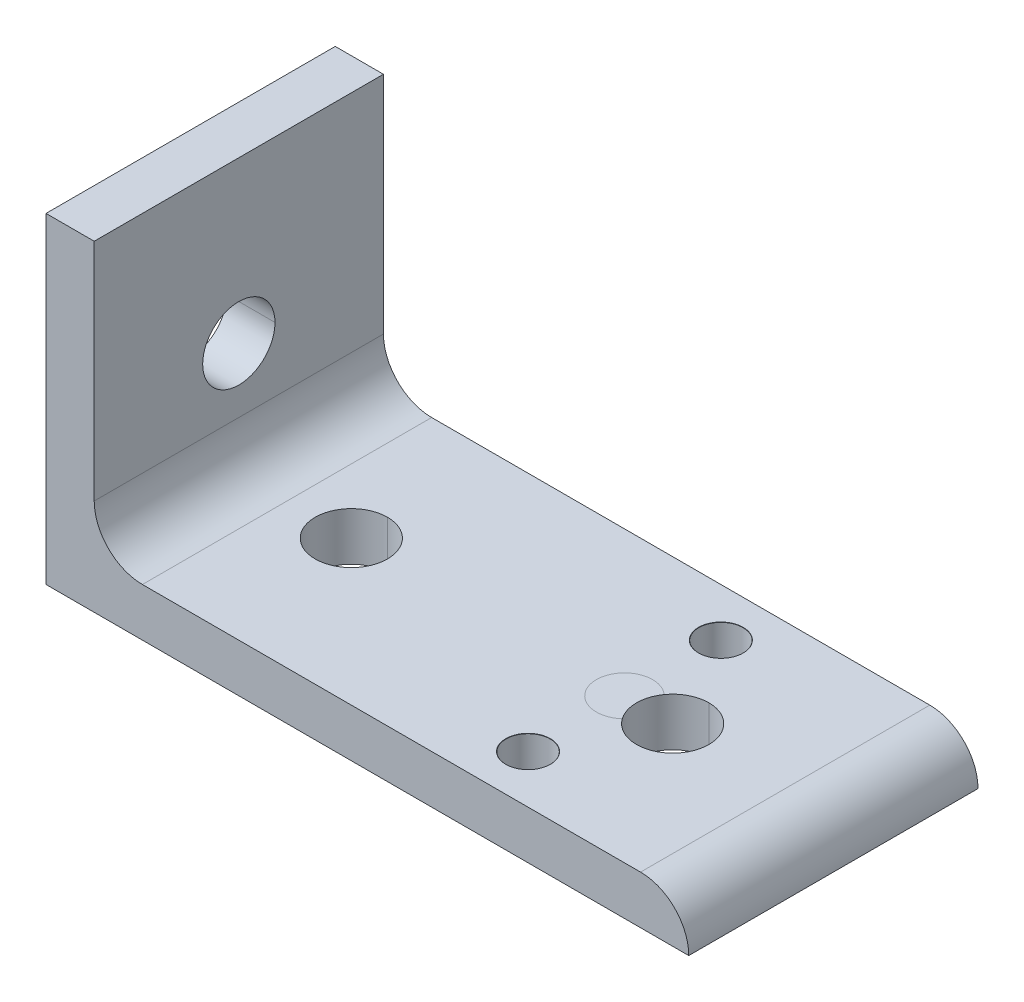
ISO-10303-21;
HEADER;
FILE_DESCRIPTION(('STEP AP214'),'2;1');
FILE_NAME('part.step','',(''),(''),'','','');
FILE_SCHEMA(('AUTOMOTIVE_DESIGN { 1 0 10303 214 1 1 1 1 }'));
ENDSEC;
DATA;
#1=APPLICATION_CONTEXT('core data for automotive mechanical design processes');
#2=APPLICATION_PROTOCOL_DEFINITION('international standard','automotive_design',2000,#1);
#3=PRODUCT_CONTEXT('',#1,'mechanical');
#4=PRODUCT('Part','Part','',(#3));
#5=PRODUCT_RELATED_PRODUCT_CATEGORY('part','',(#4));
#6=PRODUCT_DEFINITION_FORMATION('','',#4);
#7=PRODUCT_DEFINITION_CONTEXT('part definition',#1,'design');
#8=PRODUCT_DEFINITION('design','',#6,#7);
#9=PRODUCT_DEFINITION_SHAPE('','',#8);
#10=(LENGTH_UNIT() NAMED_UNIT(*) SI_UNIT(.MILLI.,.METRE.));
#11=(NAMED_UNIT(*) PLANE_ANGLE_UNIT() SI_UNIT($,.RADIAN.));
#12=(NAMED_UNIT(*) SI_UNIT($,.STERADIAN.) SOLID_ANGLE_UNIT());
#13=UNCERTAINTY_MEASURE_WITH_UNIT(LENGTH_MEASURE(1.E-05),#10,'distance_accuracy_value','');
#14=(GEOMETRIC_REPRESENTATION_CONTEXT(3) GLOBAL_UNCERTAINTY_ASSIGNED_CONTEXT((#13)) GLOBAL_UNIT_ASSIGNED_CONTEXT((#10,
#11,#12)) REPRESENTATION_CONTEXT('',''));
#15=CARTESIAN_POINT('',(0.,0.,0.));
#16=DIRECTION('',(0.,0.,1.));
#17=DIRECTION('',(1.,0.,0.));
#18=AXIS2_PLACEMENT_3D('',#15,#16,#17);
#19=CARTESIAN_POINT('',(12.,6.,18.));
#20=DIRECTION('',(0.,-1.,0.));
#21=DIRECTION('',(-1.,0.,0.));
#22=AXIS2_PLACEMENT_3D('',#19,#20,#21);
#23=PLANE('',#22);
#24=DIRECTION('',(-1.,0.,0.));
#25=VECTOR('',#24,1.);
#26=CARTESIAN_POINT('',(12.,6.,-18.));
#27=LINE('',#26,#25);
#28=CARTESIAN_POINT('',(74.,6.,-18.));
#29=VERTEX_POINT('',#28);
#30=CARTESIAN_POINT('',(12.,6.,-18.));
#31=VERTEX_POINT('',#30);
#32=EDGE_CURVE('E247',#29,#31,#27,.T.);
#33=ORIENTED_EDGE('',*,*,#32,.T.);
#34=DIRECTION('',(0.,0.,-1.));
#35=VECTOR('',#34,1.);
#36=CARTESIAN_POINT('',(12.,6.,18.));
#37=LINE('',#36,#35);
#38=CARTESIAN_POINT('',(12.,6.,18.));
#39=VERTEX_POINT('',#38);
#40=EDGE_CURVE('E253',#39,#31,#37,.T.);
#41=ORIENTED_EDGE('',*,*,#40,.F.);
#42=DIRECTION('',(-1.,0.,0.));
#43=VECTOR('',#42,1.);
#44=CARTESIAN_POINT('',(12.,6.,18.));
#45=LINE('',#44,#43);
#46=CARTESIAN_POINT('',(74.,6.,18.));
#47=VERTEX_POINT('',#46);
#48=EDGE_CURVE('E256',#47,#39,#45,.T.);
#49=ORIENTED_EDGE('',*,*,#48,.F.);
#50=DIRECTION('',(0.,0.,-1.));
#51=VECTOR('',#50,1.);
#52=CARTESIAN_POINT('',(74.,6.,18.));
#53=LINE('',#52,#51);
#54=EDGE_CURVE('E261',#47,#29,#53,.T.);
#55=ORIENTED_EDGE('',*,*,#54,.T.);
#56=EDGE_LOOP('',(#33,#41,#49,#55));
#57=FACE_BOUND('',#56,.T.);
#58=CARTESIAN_POINT('',(20.,6.,0.));
#59=DIRECTION('',(0.,1.,0.));
#60=DIRECTION('',(1.,0.,0.));
#61=AXIS2_PLACEMENT_3D('',#58,#59,#60);
#62=CIRCLE('',#61,4.5);
#63=CARTESIAN_POINT('',(20.,6.,-4.5));
#64=VERTEX_POINT('',#63);
#65=CARTESIAN_POINT('',(20.,6.,4.5));
#66=VERTEX_POINT('',#65);
#67=EDGE_CURVE('E350',#64,#66,#62,.T.);
#68=ORIENTED_EDGE('',*,*,#67,.F.);
#69=CARTESIAN_POINT('',(20.,6.,0.));
#70=DIRECTION('',(0.,1.,0.));
#71=DIRECTION('',(1.,0.,0.));
#72=AXIS2_PLACEMENT_3D('',#69,#70,#71);
#73=CIRCLE('',#72,4.5);
#74=EDGE_CURVE('E265',#66,#64,#73,.T.);
#75=ORIENTED_EDGE('',*,*,#74,.F.);
#76=EDGE_LOOP('',(#68,#75));
#77=FACE_BOUND('',#76,.T.);
#78=CARTESIAN_POINT('',(54.,6.,-12.));
#79=DIRECTION('',(0.,1.,0.));
#80=DIRECTION('',(0.,0.,1.));
#81=AXIS2_PLACEMENT_3D('',#78,#79,#80);
#82=CIRCLE('',#81,2.775);
#83=CARTESIAN_POINT('',(54.,6.,-9.225));
#84=VERTEX_POINT('',#83);
#85=EDGE_CURVE('E284',#84,#84,#82,.T.);
#86=ORIENTED_EDGE('',*,*,#85,.F.);
#87=EDGE_LOOP('',(#86));
#88=FACE_BOUND('',#87,.T.);
#89=CARTESIAN_POINT('',(54.,6.,12.));
#90=DIRECTION('',(0.,1.,0.));
#91=DIRECTION('',(0.,0.,1.));
#92=AXIS2_PLACEMENT_3D('',#89,#90,#91);
#93=CIRCLE('',#92,2.775);
#94=CARTESIAN_POINT('',(54.,6.,14.775));
#95=VERTEX_POINT('',#94);
#96=EDGE_CURVE('E293',#95,#95,#93,.T.);
#97=ORIENTED_EDGE('',*,*,#96,.F.);
#98=EDGE_LOOP('',(#97));
#99=FACE_BOUND('',#98,.T.);
#100=CARTESIAN_POINT('',(54.,6.,0.));
#101=DIRECTION('',(0.,-1.,0.));
#102=DIRECTION('',(1.,0.,0.));
#103=AXIS2_PLACEMENT_3D('',#100,#101,#102);
#104=CIRCLE('',#103,3.5);
#105=CARTESIAN_POINT('',(56.3333333333333,6.,-2.60874597374976));
#106=VERTEX_POINT('',#105);
#107=CARTESIAN_POINT('',(56.3333333333333,6.,2.60874597374976));
#108=VERTEX_POINT('',#107);
#109=EDGE_CURVE('E12',#106,#108,#104,.F.);
#110=ORIENTED_EDGE('',*,*,#109,.F.);
#111=CARTESIAN_POINT('',(60.,6.,0.));
#112=DIRECTION('',(0.,1.,0.));
#113=DIRECTION('',(1.,0.,0.));
#114=AXIS2_PLACEMENT_3D('',#111,#112,#113);
#115=CIRCLE('',#114,4.5);
#116=CARTESIAN_POINT('',(60.,6.,-4.5));
#117=VERTEX_POINT('',#116);
#118=EDGE_CURVE('E328',#117,#106,#115,.T.);
#119=ORIENTED_EDGE('',*,*,#118,.F.);
#120=CARTESIAN_POINT('',(60.,6.,0.));
#121=DIRECTION('',(0.,1.,0.));
#122=DIRECTION('',(1.,0.,0.));
#123=AXIS2_PLACEMENT_3D('',#120,#121,#122);
#124=CIRCLE('',#123,4.5);
#125=CARTESIAN_POINT('',(60.,6.,4.5));
#126=VERTEX_POINT('',#125);
#127=EDGE_CURVE('E266',#126,#117,#124,.T.);
#128=ORIENTED_EDGE('',*,*,#127,.F.);
#129=EDGE_CURVE('E338',#108,#126,#115,.T.);
#130=ORIENTED_EDGE('',*,*,#129,.F.);
#131=EDGE_LOOP('',(#110,#119,#128,#130));
#132=FACE_BOUND('',#131,.T.);
#133=ADVANCED_FACE('F63',(#57,#77,#88,#99,#132),#23,.F.);
#134=CARTESIAN_POINT('',(80.,20.,0.));
#135=DIRECTION('',(-1.,0.,0.));
#136=DIRECTION('',(0.,0.,1.));
#137=AXIS2_PLACEMENT_3D('',#134,#135,#136);
#138=CYLINDRICAL_SURFACE('',#137,4.5);
#139=DIRECTION('',(-1.,0.,0.));
#140=VECTOR('',#139,1.);
#141=CARTESIAN_POINT('',(80.,20.,-4.5));
#142=LINE('',#141,#140);
#143=CARTESIAN_POINT('',(6.,20.,-4.5));
#144=VERTEX_POINT('',#143);
#145=CARTESIAN_POINT('',(0.,20.,-4.5));
#146=VERTEX_POINT('',#145);
#147=EDGE_CURVE('E318',#144,#146,#142,.T.);
#148=ORIENTED_EDGE('',*,*,#147,.F.);
#149=CARTESIAN_POINT('',(6.,20.,0.));
#150=DIRECTION('',(1.,0.,0.));
#151=DIRECTION('',(0.,-1.,0.));
#152=AXIS2_PLACEMENT_3D('',#149,#150,#151);
#153=CIRCLE('',#152,4.5);
#154=CARTESIAN_POINT('',(6.,20.,4.5));
#155=VERTEX_POINT('',#154);
#156=EDGE_CURVE('E223',#144,#155,#153,.T.);
#157=ORIENTED_EDGE('',*,*,#156,.T.);
#158=DIRECTION('',(-1.,0.,0.));
#159=VECTOR('',#158,1.);
#160=CARTESIAN_POINT('',(80.,20.,4.5));
#161=LINE('',#160,#159);
#162=CARTESIAN_POINT('',(0.,20.,4.5));
#163=VERTEX_POINT('',#162);
#164=EDGE_CURVE('E332',#155,#163,#161,.T.);
#165=ORIENTED_EDGE('',*,*,#164,.T.);
#166=CARTESIAN_POINT('',(0.,20.,0.));
#167=DIRECTION('',(1.,0.,0.));
#168=DIRECTION('',(0.,0.,-1.));
#169=AXIS2_PLACEMENT_3D('',#166,#167,#168);
#170=CIRCLE('',#169,4.5);
#171=EDGE_CURVE('E229',#146,#163,#170,.T.);
#172=ORIENTED_EDGE('',*,*,#171,.F.);
#173=EDGE_LOOP('',(#148,#157,#165,#172));
#174=FACE_BOUND('',#173,.T.);
#175=ADVANCED_FACE('F379',(#174),#138,.F.);
#176=CARTESIAN_POINT('',(60.,80.,0.));
#177=DIRECTION('',(0.,-1.,0.));
#178=DIRECTION('',(0.,0.,-1.));
#179=AXIS2_PLACEMENT_3D('',#176,#177,#178);
#180=CYLINDRICAL_SURFACE('',#179,4.5);
#181=DIRECTION('',(0.,-1.,0.));
#182=VECTOR('',#181,1.);
#183=CARTESIAN_POINT('',(60.,80.,4.5));
#184=LINE('',#183,#182);
#185=CARTESIAN_POINT('',(60.,0.,4.5));
#186=VERTEX_POINT('',#185);
#187=EDGE_CURVE('E323',#126,#186,#184,.T.);
#188=ORIENTED_EDGE('',*,*,#187,.F.);
#189=ORIENTED_EDGE('',*,*,#127,.T.);
#190=DIRECTION('',(0.,-1.,0.));
#191=VECTOR('',#190,1.);
#192=CARTESIAN_POINT('',(60.,80.,-4.5));
#193=LINE('',#192,#191);
#194=CARTESIAN_POINT('',(60.,0.,-4.5));
#195=VERTEX_POINT('',#194);
#196=EDGE_CURVE('E354',#117,#195,#193,.T.);
#197=ORIENTED_EDGE('',*,*,#196,.T.);
#198=CARTESIAN_POINT('',(60.,0.,0.));
#199=DIRECTION('',(0.,1.,0.));
#200=DIRECTION('',(0.,0.,1.));
#201=AXIS2_PLACEMENT_3D('',#198,#199,#200);
#202=CIRCLE('',#201,4.5);
#203=EDGE_CURVE('E244',#186,#195,#202,.T.);
#204=ORIENTED_EDGE('',*,*,#203,.F.);
#205=EDGE_LOOP('',(#188,#189,#197,#204));
#206=FACE_BOUND('',#205,.T.);
#207=ADVANCED_FACE('F427',(#206),#180,.F.);
#208=CARTESIAN_POINT('',(20.,80.,0.));
#209=DIRECTION('',(0.,-1.,0.));
#210=DIRECTION('',(0.,0.,-1.));
#211=AXIS2_PLACEMENT_3D('',#208,#209,#210);
#212=CYLINDRICAL_SURFACE('',#211,4.5);
#213=DIRECTION('',(0.,-1.,0.));
#214=VECTOR('',#213,1.);
#215=CARTESIAN_POINT('',(20.,80.,4.5));
#216=LINE('',#215,#214);
#217=CARTESIAN_POINT('',(20.,0.,4.5));
#218=VERTEX_POINT('',#217);
#219=EDGE_CURVE('E346',#66,#218,#216,.T.);
#220=ORIENTED_EDGE('',*,*,#219,.F.);
#221=ORIENTED_EDGE('',*,*,#74,.T.);
#222=DIRECTION('',(0.,-1.,0.));
#223=VECTOR('',#222,1.);
#224=CARTESIAN_POINT('',(20.,80.,-4.5));
#225=LINE('',#224,#223);
#226=CARTESIAN_POINT('',(20.,0.,-4.5));
#227=VERTEX_POINT('',#226);
#228=EDGE_CURVE('E210',#64,#227,#225,.T.);
#229=ORIENTED_EDGE('',*,*,#228,.T.);
#230=CARTESIAN_POINT('',(20.,0.,0.));
#231=DIRECTION('',(0.,1.,0.));
#232=DIRECTION('',(0.,0.,1.));
#233=AXIS2_PLACEMENT_3D('',#230,#231,#232);
#234=CIRCLE('',#233,4.5);
#235=EDGE_CURVE('E248',#218,#227,#234,.T.);
#236=ORIENTED_EDGE('',*,*,#235,.F.);
#237=EDGE_LOOP('',(#220,#221,#229,#236));
#238=FACE_BOUND('',#237,.T.);
#239=ADVANCED_FACE('F375',(#238),#212,.F.);
#240=CARTESIAN_POINT('',(0.,74.,-18.));
#241=DIRECTION('',(0.,0.,1.));
#242=DIRECTION('',(1.,0.,0.));
#243=AXIS2_PLACEMENT_3D('',#240,#241,#242);
#244=PLANE('',#243);
#245=DIRECTION('',(0.,-1.,0.));
#246=VECTOR('',#245,1.);
#247=CARTESIAN_POINT('',(0.,0.,-18.));
#248=LINE('',#247,#246);
#249=CARTESIAN_POINT('',(0.,40.,-18.));
#250=VERTEX_POINT('',#249);
#251=CARTESIAN_POINT('',(0.,0.,-18.));
#252=VERTEX_POINT('',#251);
#253=EDGE_CURVE('E200',#250,#252,#248,.T.);
#254=ORIENTED_EDGE('',*,*,#253,.F.);
#255=DIRECTION('',(-1.,0.,0.));
#256=VECTOR('',#255,1.);
#257=CARTESIAN_POINT('',(26.3729055621326,40.,-18.));
#258=LINE('',#257,#256);
#259=CARTESIAN_POINT('',(6.,40.,-18.));
#260=VERTEX_POINT('',#259);
#261=EDGE_CURVE('E184',#260,#250,#258,.T.);
#262=ORIENTED_EDGE('',*,*,#261,.F.);
#263=DIRECTION('',(0.,1.,0.));
#264=VECTOR('',#263,1.);
#265=CARTESIAN_POINT('',(6.,74.,-18.));
#266=LINE('',#265,#264);
#267=CARTESIAN_POINT('',(6.,12.,-18.));
#268=VERTEX_POINT('',#267);
#269=EDGE_CURVE('E198',#268,#260,#266,.T.);
#270=ORIENTED_EDGE('',*,*,#269,.F.);
#271=CARTESIAN_POINT('',(12.,12.,-18.));
#272=DIRECTION('',(0.,0.,-1.));
#273=DIRECTION('',(1.,0.,0.));
#274=AXIS2_PLACEMENT_3D('',#271,#272,#273);
#275=CIRCLE('',#274,6.);
#276=EDGE_CURVE('E273',#31,#268,#275,.T.);
#277=ORIENTED_EDGE('',*,*,#276,.F.);
#278=ORIENTED_EDGE('',*,*,#32,.F.);
#279=CARTESIAN_POINT('',(74.,0.,-18.));
#280=DIRECTION('',(0.,0.,1.));
#281=DIRECTION('',(1.,0.,0.));
#282=AXIS2_PLACEMENT_3D('',#279,#280,#281);
#283=CIRCLE('',#282,6.);
#284=CARTESIAN_POINT('',(80.,0.,-18.));
#285=VERTEX_POINT('',#284);
#286=EDGE_CURVE('E269',#285,#29,#283,.T.);
#287=ORIENTED_EDGE('',*,*,#286,.F.);
#288=DIRECTION('',(1.,0.,0.));
#289=VECTOR('',#288,1.);
#290=CARTESIAN_POINT('',(80.,0.,-18.));
#291=LINE('',#290,#289);
#292=EDGE_CURVE('E234',#252,#285,#291,.T.);
#293=ORIENTED_EDGE('',*,*,#292,.F.);
#294=EDGE_LOOP('',(#254,#262,#270,#277,#278,#287,#293));
#295=FACE_BOUND('',#294,.T.);
#296=ADVANCED_FACE('F65',(#295),#244,.F.);
#297=CARTESIAN_POINT('',(0.,74.,18.));
#298=DIRECTION('',(0.,0.,1.));
#299=DIRECTION('',(1.,0.,0.));
#300=AXIS2_PLACEMENT_3D('',#297,#298,#299);
#301=PLANE('',#300);
#302=DIRECTION('',(-1.,0.,0.));
#303=VECTOR('',#302,1.);
#304=CARTESIAN_POINT('',(26.3729055621326,40.,18.));
#305=LINE('',#304,#303);
#306=CARTESIAN_POINT('',(6.,40.,18.));
#307=VERTEX_POINT('',#306);
#308=CARTESIAN_POINT('',(0.,40.,18.));
#309=VERTEX_POINT('',#308);
#310=EDGE_CURVE('E187',#307,#309,#305,.T.);
#311=ORIENTED_EDGE('',*,*,#310,.T.);
#312=DIRECTION('',(0.,-1.,0.));
#313=VECTOR('',#312,1.);
#314=CARTESIAN_POINT('',(0.,0.,18.));
#315=LINE('',#314,#313);
#316=CARTESIAN_POINT('',(0.,0.,18.));
#317=VERTEX_POINT('',#316);
#318=EDGE_CURVE('E226',#309,#317,#315,.T.);
#319=ORIENTED_EDGE('',*,*,#318,.T.);
#320=DIRECTION('',(1.,0.,0.));
#321=VECTOR('',#320,1.);
#322=CARTESIAN_POINT('',(80.,0.,18.));
#323=LINE('',#322,#321);
#324=CARTESIAN_POINT('',(80.,0.,18.));
#325=VERTEX_POINT('',#324);
#326=EDGE_CURVE('E243',#317,#325,#323,.T.);
#327=ORIENTED_EDGE('',*,*,#326,.T.);
#328=CARTESIAN_POINT('',(74.,0.,18.));
#329=DIRECTION('',(0.,0.,1.));
#330=DIRECTION('',(1.,0.,0.));
#331=AXIS2_PLACEMENT_3D('',#328,#329,#330);
#332=CIRCLE('',#331,6.);
#333=EDGE_CURVE('E270',#325,#47,#332,.T.);
#334=ORIENTED_EDGE('',*,*,#333,.T.);
#335=ORIENTED_EDGE('',*,*,#48,.T.);
#336=CARTESIAN_POINT('',(12.,12.,18.));
#337=DIRECTION('',(0.,0.,-1.));
#338=DIRECTION('',(1.,0.,0.));
#339=AXIS2_PLACEMENT_3D('',#336,#337,#338);
#340=CIRCLE('',#339,6.);
#341=CARTESIAN_POINT('',(6.,12.,18.));
#342=VERTEX_POINT('',#341);
#343=EDGE_CURVE('E193',#39,#342,#340,.T.);
#344=ORIENTED_EDGE('',*,*,#343,.T.);
#345=DIRECTION('',(0.,1.,0.));
#346=VECTOR('',#345,1.);
#347=CARTESIAN_POINT('',(6.,74.,18.));
#348=LINE('',#347,#346);
#349=EDGE_CURVE('E209',#342,#307,#348,.T.);
#350=ORIENTED_EDGE('',*,*,#349,.T.);
#351=EDGE_LOOP('',(#311,#319,#327,#334,#335,#344,#350));
#352=FACE_BOUND('',#351,.T.);
#353=ADVANCED_FACE('F419',(#352),#301,.T.);
#354=CARTESIAN_POINT('',(12.,12.,18.));
#355=DIRECTION('',(0.,0.,-1.));
#356=DIRECTION('',(-1.,0.,0.));
#357=AXIS2_PLACEMENT_3D('',#354,#355,#356);
#358=CYLINDRICAL_SURFACE('',#357,6.);
#359=ORIENTED_EDGE('',*,*,#276,.T.);
#360=DIRECTION('',(0.,0.,-1.));
#361=VECTOR('',#360,1.);
#362=CARTESIAN_POINT('',(6.,12.,18.));
#363=LINE('',#362,#361);
#364=EDGE_CURVE('E207',#342,#268,#363,.T.);
#365=ORIENTED_EDGE('',*,*,#364,.F.);
#366=ORIENTED_EDGE('',*,*,#343,.F.);
#367=ORIENTED_EDGE('',*,*,#40,.T.);
#368=EDGE_LOOP('',(#359,#365,#366,#367));
#369=FACE_BOUND('',#368,.T.);
#370=ADVANCED_FACE('F415',(#369),#358,.F.);
#371=CARTESIAN_POINT('',(74.,0.,18.));
#372=DIRECTION('',(0.,0.,-1.));
#373=DIRECTION('',(-1.,0.,0.));
#374=AXIS2_PLACEMENT_3D('',#371,#372,#373);
#375=CYLINDRICAL_SURFACE('',#374,6.);
#376=ORIENTED_EDGE('',*,*,#286,.T.);
#377=ORIENTED_EDGE('',*,*,#54,.F.);
#378=ORIENTED_EDGE('',*,*,#333,.F.);
#379=DIRECTION('',(0.,0.,-1.));
#380=VECTOR('',#379,1.);
#381=CARTESIAN_POINT('',(80.,0.,18.));
#382=LINE('',#381,#380);
#383=EDGE_CURVE('E239',#325,#285,#382,.T.);
#384=ORIENTED_EDGE('',*,*,#383,.T.);
#385=EDGE_LOOP('',(#376,#377,#378,#384));
#386=FACE_BOUND('',#385,.T.);
#387=ADVANCED_FACE('F418',(#386),#375,.T.);
#388=EDGE_CURVE('E345',#106,#108,#115,.T.);
#389=ORIENTED_EDGE('',*,*,#388,.F.);
#390=ORIENTED_EDGE('',*,*,#109,.T.);
#391=EDGE_LOOP('',(#389,#390));
#392=FACE_BOUND('',#391,.T.);
#393=ADVANCED_FACE('F382',(#392),#23,.F.);
#394=CARTESIAN_POINT('',(80.,0.,18.));
#395=DIRECTION('',(0.,1.,0.));
#396=DIRECTION('',(1.,0.,0.));
#397=AXIS2_PLACEMENT_3D('',#394,#395,#396);
#398=PLANE('',#397);
#399=CARTESIAN_POINT('',(54.,0.,12.));
#400=DIRECTION('',(0.,1.,0.));
#401=DIRECTION('',(-1.,0.,0.));
#402=AXIS2_PLACEMENT_3D('',#399,#400,#401);
#403=CIRCLE('',#402,2.74999999999999);
#404=CARTESIAN_POINT('',(51.25,0.,12.));
#405=VERTEX_POINT('',#404);
#406=EDGE_CURVE('E281',#405,#405,#403,.T.);
#407=ORIENTED_EDGE('',*,*,#406,.T.);
#408=EDGE_LOOP('',(#407));
#409=FACE_BOUND('',#408,.T.);
#410=CARTESIAN_POINT('',(54.,0.,-12.));
#411=DIRECTION('',(0.,1.,0.));
#412=DIRECTION('',(-1.,0.,0.));
#413=AXIS2_PLACEMENT_3D('',#410,#411,#412);
#414=CIRCLE('',#413,2.74999999999999);
#415=CARTESIAN_POINT('',(51.25,0.,-12.));
#416=VERTEX_POINT('',#415);
#417=EDGE_CURVE('E202',#416,#416,#414,.T.);
#418=ORIENTED_EDGE('',*,*,#417,.T.);
#419=EDGE_LOOP('',(#418));
#420=FACE_BOUND('',#419,.T.);
#421=CARTESIAN_POINT('',(60.,0.,0.));
#422=DIRECTION('',(0.,1.,0.));
#423=DIRECTION('',(0.,0.,1.));
#424=AXIS2_PLACEMENT_3D('',#421,#422,#423);
#425=CIRCLE('',#424,4.5);
#426=EDGE_CURVE('E327',#195,#186,#425,.T.);
#427=ORIENTED_EDGE('',*,*,#426,.T.);
#428=ORIENTED_EDGE('',*,*,#203,.T.);
#429=EDGE_LOOP('',(#427,#428));
#430=FACE_BOUND('',#429,.T.);
#431=CARTESIAN_POINT('',(20.,0.,0.));
#432=DIRECTION('',(0.,1.,0.));
#433=DIRECTION('',(0.,0.,1.));
#434=AXIS2_PLACEMENT_3D('',#431,#432,#433);
#435=CIRCLE('',#434,4.5);
#436=EDGE_CURVE('E217',#227,#218,#435,.T.);
#437=ORIENTED_EDGE('',*,*,#436,.T.);
#438=ORIENTED_EDGE('',*,*,#235,.T.);
#439=EDGE_LOOP('',(#437,#438));
#440=FACE_BOUND('',#439,.T.);
#441=ORIENTED_EDGE('',*,*,#292,.T.);
#442=ORIENTED_EDGE('',*,*,#383,.F.);
#443=ORIENTED_EDGE('',*,*,#326,.F.);
#444=DIRECTION('',(0.,0.,-1.));
#445=VECTOR('',#444,1.);
#446=CARTESIAN_POINT('',(0.,0.,18.));
#447=LINE('',#446,#445);
#448=EDGE_CURVE('E230',#317,#252,#447,.T.);
#449=ORIENTED_EDGE('',*,*,#448,.T.);
#450=EDGE_LOOP('',(#441,#442,#443,#449));
#451=FACE_BOUND('',#450,.T.);
#452=ADVANCED_FACE('F367',(#409,#420,#430,#440,#451),#398,.F.);
#453=CARTESIAN_POINT('',(0.,0.,18.));
#454=DIRECTION('',(1.,0.,0.));
#455=DIRECTION('',(0.,1.,0.));
#456=AXIS2_PLACEMENT_3D('',#453,#454,#455);
#457=PLANE('',#456);
#458=CARTESIAN_POINT('',(0.,20.,0.));
#459=DIRECTION('',(1.,0.,0.));
#460=DIRECTION('',(0.,0.,-1.));
#461=AXIS2_PLACEMENT_3D('',#458,#459,#460);
#462=CIRCLE('',#461,4.5);
#463=EDGE_CURVE('E322',#163,#146,#462,.T.);
#464=ORIENTED_EDGE('',*,*,#463,.T.);
#465=ORIENTED_EDGE('',*,*,#171,.T.);
#466=EDGE_LOOP('',(#464,#465));
#467=FACE_BOUND('',#466,.T.);
#468=ORIENTED_EDGE('',*,*,#318,.F.);
#469=DIRECTION('',(0.,0.,-1.));
#470=VECTOR('',#469,1.);
#471=CARTESIAN_POINT('',(0.,40.,18.));
#472=LINE('',#471,#470);
#473=EDGE_CURVE('E305',#309,#250,#472,.T.);
#474=ORIENTED_EDGE('',*,*,#473,.T.);
#475=ORIENTED_EDGE('',*,*,#253,.T.);
#476=ORIENTED_EDGE('',*,*,#448,.F.);
#477=EDGE_LOOP('',(#468,#474,#475,#476));
#478=FACE_BOUND('',#477,.T.);
#479=ADVANCED_FACE('F421',(#467,#478),#457,.F.);
#480=CARTESIAN_POINT('',(6.,74.,18.));
#481=DIRECTION('',(-1.,0.,0.));
#482=DIRECTION('',(0.,1.,0.));
#483=AXIS2_PLACEMENT_3D('',#480,#481,#482);
#484=PLANE('',#483);
#485=CARTESIAN_POINT('',(6.,20.,0.));
#486=DIRECTION('',(1.,0.,0.));
#487=DIRECTION('',(0.,-1.,0.));
#488=AXIS2_PLACEMENT_3D('',#485,#486,#487);
#489=CIRCLE('',#488,4.5);
#490=EDGE_CURVE('E309',#155,#144,#489,.T.);
#491=ORIENTED_EDGE('',*,*,#490,.F.);
#492=ORIENTED_EDGE('',*,*,#156,.F.);
#493=EDGE_LOOP('',(#491,#492));
#494=FACE_BOUND('',#493,.T.);
#495=ORIENTED_EDGE('',*,*,#269,.T.);
#496=DIRECTION('',(0.,0.,1.));
#497=VECTOR('',#496,1.);
#498=CARTESIAN_POINT('',(6.,40.,18.));
#499=LINE('',#498,#497);
#500=EDGE_CURVE('E72',#260,#307,#499,.T.);
#501=ORIENTED_EDGE('',*,*,#500,.T.);
#502=ORIENTED_EDGE('',*,*,#349,.F.);
#503=ORIENTED_EDGE('',*,*,#364,.T.);
#504=EDGE_LOOP('',(#495,#501,#502,#503));
#505=FACE_BOUND('',#504,.T.);
#506=ADVANCED_FACE('F205',(#494,#505),#484,.F.);
#507=CARTESIAN_POINT('',(20.,80.,0.));
#508=DIRECTION('',(0.,-1.,0.));
#509=DIRECTION('',(0.,0.,-1.));
#510=AXIS2_PLACEMENT_3D('',#507,#508,#509);
#511=CYLINDRICAL_SURFACE('',#510,4.5);
#512=ORIENTED_EDGE('',*,*,#67,.T.);
#513=ORIENTED_EDGE('',*,*,#219,.T.);
#514=ORIENTED_EDGE('',*,*,#436,.F.);
#515=ORIENTED_EDGE('',*,*,#228,.F.);
#516=EDGE_LOOP('',(#512,#513,#514,#515));
#517=FACE_BOUND('',#516,.T.);
#518=ADVANCED_FACE('F372',(#517),#511,.F.);
#519=CARTESIAN_POINT('',(60.,80.,0.));
#520=DIRECTION('',(0.,-1.,0.));
#521=DIRECTION('',(0.,0.,-1.));
#522=AXIS2_PLACEMENT_3D('',#519,#520,#521);
#523=CYLINDRICAL_SURFACE('',#522,4.5);
#524=ORIENTED_EDGE('',*,*,#118,.T.);
#525=ORIENTED_EDGE('',*,*,#388,.T.);
#526=ORIENTED_EDGE('',*,*,#129,.T.);
#527=ORIENTED_EDGE('',*,*,#187,.T.);
#528=ORIENTED_EDGE('',*,*,#426,.F.);
#529=ORIENTED_EDGE('',*,*,#196,.F.);
#530=EDGE_LOOP('',(#524,#525,#526,#527,#528,#529));
#531=FACE_BOUND('',#530,.T.);
#532=ADVANCED_FACE('F410',(#531),#523,.F.);
#533=CARTESIAN_POINT('',(80.,20.,0.));
#534=DIRECTION('',(-1.,0.,0.));
#535=DIRECTION('',(0.,0.,1.));
#536=AXIS2_PLACEMENT_3D('',#533,#534,#535);
#537=CYLINDRICAL_SURFACE('',#536,4.5);
#538=ORIENTED_EDGE('',*,*,#490,.T.);
#539=ORIENTED_EDGE('',*,*,#147,.T.);
#540=ORIENTED_EDGE('',*,*,#463,.F.);
#541=ORIENTED_EDGE('',*,*,#164,.F.);
#542=EDGE_LOOP('',(#538,#539,#540,#541));
#543=FACE_BOUND('',#542,.T.);
#544=ADVANCED_FACE('F407',(#543),#537,.F.);
#545=CARTESIAN_POINT('',(26.3729055621326,40.,18.));
#546=DIRECTION('',(0.,-1.,0.));
#547=DIRECTION('',(0.,0.,-1.));
#548=AXIS2_PLACEMENT_3D('',#545,#546,#547);
#549=PLANE('',#548);
#550=ORIENTED_EDGE('',*,*,#310,.F.);
#551=ORIENTED_EDGE('',*,*,#500,.F.);
#552=ORIENTED_EDGE('',*,*,#261,.T.);
#553=ORIENTED_EDGE('',*,*,#473,.F.);
#554=EDGE_LOOP('',(#550,#551,#552,#553));
#555=FACE_BOUND('',#554,.T.);
#556=ADVANCED_FACE('F183',(#555),#549,.F.);
#557=CARTESIAN_POINT('',(54.,6.,-12.));
#558=DIRECTION('',(0.,1.,0.));
#559=DIRECTION('',(0.,0.,1.));
#560=AXIS2_PLACEMENT_3D('',#557,#558,#559);
#561=CYLINDRICAL_SURFACE('',#560,2.74999999999999);
#562=CARTESIAN_POINT('',(54.,5.97499999999999,-12.));
#563=DIRECTION('',(0.,1.,0.));
#564=DIRECTION('',(0.,0.,1.));
#565=AXIS2_PLACEMENT_3D('',#562,#563,#564);
#566=CIRCLE('',#565,2.74999999999999);
#567=CARTESIAN_POINT('',(54.,5.97499999999999,-9.25000000000001));
#568=VERTEX_POINT('',#567);
#569=EDGE_CURVE('E280',#568,#568,#566,.T.);
#570=ORIENTED_EDGE('',*,*,#569,.T.);
#571=EDGE_LOOP('',(#570));
#572=FACE_BOUND('',#571,.T.);
#573=ORIENTED_EDGE('',*,*,#417,.F.);
#574=EDGE_LOOP('',(#573));
#575=FACE_BOUND('',#574,.T.);
#576=ADVANCED_FACE('F400',(#572,#575),#561,.F.);
#577=CARTESIAN_POINT('',(54.,6.,-12.));
#578=DIRECTION('',(0.,1.,0.));
#579=DIRECTION('',(0.,0.,1.));
#580=AXIS2_PLACEMENT_3D('',#577,#578,#579);
#581=CONICAL_SURFACE('',#580,2.775,0.785398163397414);
#582=ORIENTED_EDGE('',*,*,#569,.F.);
#583=EDGE_LOOP('',(#582));
#584=FACE_BOUND('',#583,.T.);
#585=ORIENTED_EDGE('',*,*,#85,.T.);
#586=EDGE_LOOP('',(#585));
#587=FACE_BOUND('',#586,.T.);
#588=ADVANCED_FACE('F395',(#584,#587),#581,.F.);
#589=CARTESIAN_POINT('',(54.,6.,12.));
#590=DIRECTION('',(0.,1.,0.));
#591=DIRECTION('',(0.,0.,1.));
#592=AXIS2_PLACEMENT_3D('',#589,#590,#591);
#593=CYLINDRICAL_SURFACE('',#592,2.74999999999999);
#594=CARTESIAN_POINT('',(54.,5.97499999999999,12.));
#595=DIRECTION('',(0.,1.,0.));
#596=DIRECTION('',(0.,0.,1.));
#597=AXIS2_PLACEMENT_3D('',#594,#595,#596);
#598=CIRCLE('',#597,2.74999999999999);
#599=CARTESIAN_POINT('',(54.,5.97499999999999,14.75));
#600=VERTEX_POINT('',#599);
#601=EDGE_CURVE('E285',#600,#600,#598,.T.);
#602=ORIENTED_EDGE('',*,*,#601,.T.);
#603=EDGE_LOOP('',(#602));
#604=FACE_BOUND('',#603,.T.);
#605=ORIENTED_EDGE('',*,*,#406,.F.);
#606=EDGE_LOOP('',(#605));
#607=FACE_BOUND('',#606,.T.);
#608=ADVANCED_FACE('F389',(#604,#607),#593,.F.);
#609=CARTESIAN_POINT('',(54.,6.,12.));
#610=DIRECTION('',(0.,1.,0.));
#611=DIRECTION('',(0.,0.,1.));
#612=AXIS2_PLACEMENT_3D('',#609,#610,#611);
#613=CONICAL_SURFACE('',#612,2.775,0.785398163397414);
#614=ORIENTED_EDGE('',*,*,#601,.F.);
#615=EDGE_LOOP('',(#614));
#616=FACE_BOUND('',#615,.T.);
#617=ORIENTED_EDGE('',*,*,#96,.T.);
#618=EDGE_LOOP('',(#617));
#619=FACE_BOUND('',#618,.T.);
#620=ADVANCED_FACE('F387',(#616,#619),#613,.F.);
#621=CLOSED_SHELL('',(#133,#175,#207,#239,#296,#353,#370,#387,#393,#452,#479,#506,#518,#532,
#544,#556,#576,#588,#608,#620));
#622=MANIFOLD_SOLID_BREP('B2',#621);
#623=ADVANCED_BREP_SHAPE_REPRESENTATION('',(#18,#622),#14);
#624=SHAPE_DEFINITION_REPRESENTATION(#9,#623);
ENDSEC;
END-ISO-10303-21;
